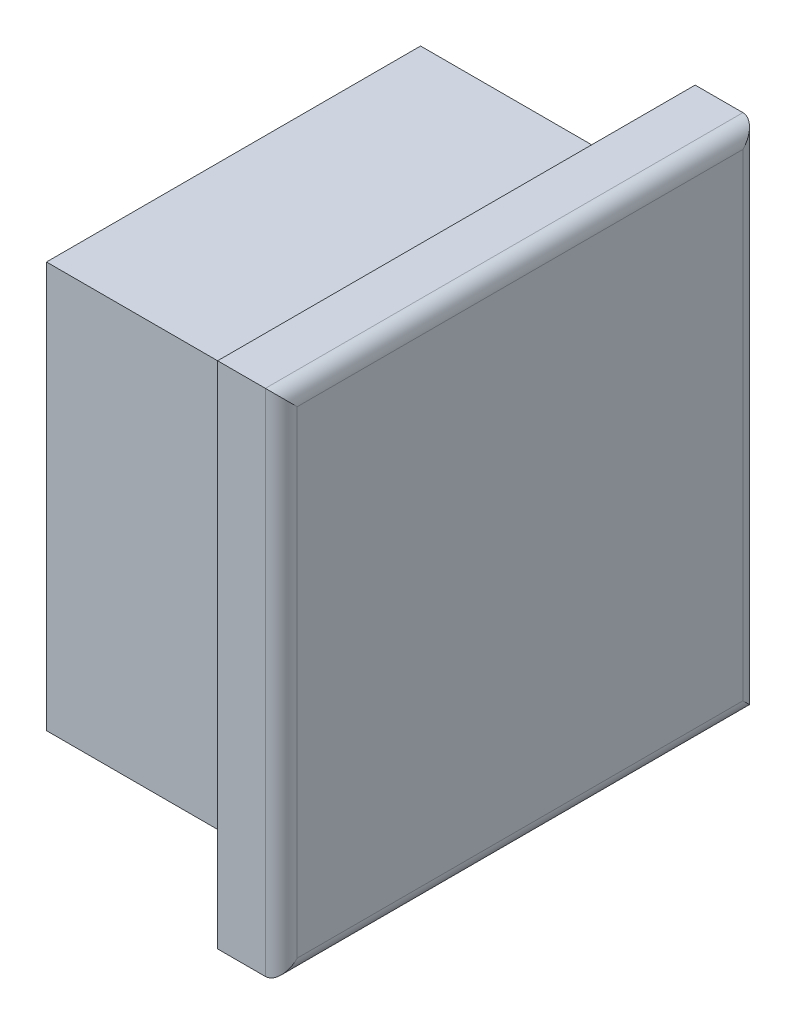
ISO-10303-21;
HEADER;
FILE_DESCRIPTION(('STEP AP214'),'2;1');
FILE_NAME('part.step','',(''),(''),'','','');
FILE_SCHEMA(('AUTOMOTIVE_DESIGN { 1 0 10303 214 1 1 1 1 }'));
ENDSEC;
DATA;
#1=APPLICATION_CONTEXT('core data for automotive mechanical design processes');
#2=APPLICATION_PROTOCOL_DEFINITION('international standard','automotive_design',2000,#1);
#3=PRODUCT_CONTEXT('',#1,'mechanical');
#4=PRODUCT('Part','Part','',(#3));
#5=PRODUCT_RELATED_PRODUCT_CATEGORY('part','',(#4));
#6=PRODUCT_DEFINITION_FORMATION('','',#4);
#7=PRODUCT_DEFINITION_CONTEXT('part definition',#1,'design');
#8=PRODUCT_DEFINITION('design','',#6,#7);
#9=PRODUCT_DEFINITION_SHAPE('','',#8);
#10=(LENGTH_UNIT() NAMED_UNIT(*) SI_UNIT(.MILLI.,.METRE.));
#11=(NAMED_UNIT(*) PLANE_ANGLE_UNIT() SI_UNIT($,.RADIAN.));
#12=(NAMED_UNIT(*) SI_UNIT($,.STERADIAN.) SOLID_ANGLE_UNIT());
#13=UNCERTAINTY_MEASURE_WITH_UNIT(LENGTH_MEASURE(1.E-05),#10,'distance_accuracy_value','');
#14=(GEOMETRIC_REPRESENTATION_CONTEXT(3) GLOBAL_UNCERTAINTY_ASSIGNED_CONTEXT((#13)) GLOBAL_UNIT_ASSIGNED_CONTEXT((#10,
#11,#12)) REPRESENTATION_CONTEXT('',''));
#15=CARTESIAN_POINT('',(0.,0.,0.));
#16=DIRECTION('',(0.,0.,1.));
#17=DIRECTION('',(1.,0.,0.));
#18=AXIS2_PLACEMENT_3D('',#15,#16,#17);
#19=CARTESIAN_POINT('',(-1.032002,-15.999968,14.99997));
#20=DIRECTION('',(-1.,0.,0.));
#21=DIRECTION('',(0.,0.,1.));
#22=AXIS2_PLACEMENT_3D('',#19,#20,#21);
#23=PLANE('',#22);
#24=DIRECTION('',(0.,0.,-1.));
#25=VECTOR('',#24,1.);
#26=CARTESIAN_POINT('',(-1.032002,-26.7179425,3.2499935));
#27=LINE('',#26,#25);
#28=CARTESIAN_POINT('',(-1.032002,-26.7179425,5.2819935));
#29=VERTEX_POINT('',#28);
#30=CARTESIAN_POINT('',(-1.032002,-26.7179425,24.7179465));
#31=VERTEX_POINT('',#30);
#32=EDGE_CURVE('E136',#29,#31,#27,.F.);
#33=ORIENTED_EDGE('',*,*,#32,.T.);
#34=DIRECTION('',(0.,1.,0.));
#35=VECTOR('',#34,1.);
#36=CARTESIAN_POINT('',(-1.032002,-28.7499425,24.7179465));
#37=LINE('',#36,#35);
#38=CARTESIAN_POINT('',(-1.032002,-5.2819935,24.7179465));
#39=VERTEX_POINT('',#38);
#40=EDGE_CURVE('E131',#31,#39,#37,.T.);
#41=ORIENTED_EDGE('',*,*,#40,.T.);
#42=DIRECTION('',(0.,0.,1.));
#43=VECTOR('',#42,1.);
#44=CARTESIAN_POINT('',(-1.032002,-5.2819935,26.7499465));
#45=LINE('',#44,#43);
#46=CARTESIAN_POINT('',(-1.032002,-5.2819935,5.2819935));
#47=VERTEX_POINT('',#46);
#48=EDGE_CURVE('E116',#39,#47,#45,.F.);
#49=ORIENTED_EDGE('',*,*,#48,.T.);
#50=DIRECTION('',(0.,1.,0.));
#51=VECTOR('',#50,1.);
#52=CARTESIAN_POINT('',(-1.032002,-3.2499935,5.2819935));
#53=LINE('',#52,#51);
#54=EDGE_CURVE('E220',#47,#29,#53,.F.);
#55=ORIENTED_EDGE('',*,*,#54,.T.);
#56=EDGE_LOOP('',(#33,#41,#49,#55));
#57=FACE_BOUND('',#56,.T.);
#58=ADVANCED_FACE('F15',(#57),#23,.T.);
#59=CARTESIAN_POINT('',(-16.999966,-5.2819935,26.7499465));
#60=DIRECTION('',(0.,1.,0.));
#61=DIRECTION('',(0.,0.,1.));
#62=AXIS2_PLACEMENT_3D('',#59,#60,#61);
#63=PLANE('',#62);
#64=DIRECTION('',(1.,0.,0.));
#65=VECTOR('',#64,1.);
#66=CARTESIAN_POINT('',(-16.999966,-5.2819935,24.7179465));
#67=LINE('',#66,#65);
#68=CARTESIAN_POINT('',(-16.999966,-5.2819935,24.7179465));
#69=VERTEX_POINT('',#68);
#70=EDGE_CURVE('E120',#39,#69,#67,.F.);
#71=ORIENTED_EDGE('',*,*,#70,.T.);
#72=DIRECTION('',(0.,0.,1.));
#73=VECTOR('',#72,1.);
#74=CARTESIAN_POINT('',(-16.999966,-5.2819935,14.99997));
#75=LINE('',#74,#73);
#76=CARTESIAN_POINT('',(-16.999966,-5.2819935,5.2819935));
#77=VERTEX_POINT('',#76);
#78=EDGE_CURVE('E218',#77,#69,#75,.T.);
#79=ORIENTED_EDGE('',*,*,#78,.F.);
#80=DIRECTION('',(-1.,0.,0.));
#81=VECTOR('',#80,1.);
#82=CARTESIAN_POINT('',(-16.999966,-5.2819935,5.2819935));
#83=LINE('',#82,#81);
#84=EDGE_CURVE('E122',#77,#47,#83,.F.);
#85=ORIENTED_EDGE('',*,*,#84,.T.);
#86=ORIENTED_EDGE('',*,*,#48,.F.);
#87=EDGE_LOOP('',(#71,#79,#85,#86));
#88=FACE_BOUND('',#87,.T.);
#89=ADVANCED_FACE('F118',(#88),#63,.F.);
#90=CARTESIAN_POINT('',(-16.999966,-28.7499425,24.7179465));
#91=DIRECTION('',(0.,0.,1.));
#92=DIRECTION('',(1.,0.,0.));
#93=AXIS2_PLACEMENT_3D('',#90,#91,#92);
#94=PLANE('',#93);
#95=DIRECTION('',(1.,0.,0.));
#96=VECTOR('',#95,1.);
#97=CARTESIAN_POINT('',(-16.999966,-26.7179425,24.7179465));
#98=LINE('',#97,#96);
#99=CARTESIAN_POINT('',(-16.999966,-26.7179425,24.7179465));
#100=VERTEX_POINT('',#99);
#101=EDGE_CURVE('E137',#31,#100,#98,.F.);
#102=ORIENTED_EDGE('',*,*,#101,.T.);
#103=DIRECTION('',(0.,1.,0.));
#104=VECTOR('',#103,1.);
#105=CARTESIAN_POINT('',(-16.999966,-15.999968,24.7179465));
#106=LINE('',#105,#104);
#107=EDGE_CURVE('E133',#69,#100,#106,.F.);
#108=ORIENTED_EDGE('',*,*,#107,.F.);
#109=ORIENTED_EDGE('',*,*,#70,.F.);
#110=ORIENTED_EDGE('',*,*,#40,.F.);
#111=EDGE_LOOP('',(#102,#108,#109,#110));
#112=FACE_BOUND('',#111,.T.);
#113=ADVANCED_FACE('F130',(#112),#94,.F.);
#114=CARTESIAN_POINT('',(-16.999966,-26.7179425,3.2499935));
#115=DIRECTION('',(0.,-1.,0.));
#116=DIRECTION('',(0.,0.,-1.));
#117=AXIS2_PLACEMENT_3D('',#114,#115,#116);
#118=PLANE('',#117);
#119=DIRECTION('',(-1.,0.,0.));
#120=VECTOR('',#119,1.);
#121=CARTESIAN_POINT('',(-16.999966,-26.7179425,5.2819935));
#122=LINE('',#121,#120);
#123=CARTESIAN_POINT('',(-16.999966,-26.7179425,5.2819935));
#124=VERTEX_POINT('',#123);
#125=EDGE_CURVE('E223',#29,#124,#122,.T.);
#126=ORIENTED_EDGE('',*,*,#125,.T.);
#127=DIRECTION('',(0.,0.,1.));
#128=VECTOR('',#127,1.);
#129=CARTESIAN_POINT('',(-16.999966,-26.7179425,14.99997));
#130=LINE('',#129,#128);
#131=EDGE_CURVE('E215',#100,#124,#130,.F.);
#132=ORIENTED_EDGE('',*,*,#131,.F.);
#133=ORIENTED_EDGE('',*,*,#101,.F.);
#134=ORIENTED_EDGE('',*,*,#32,.F.);
#135=EDGE_LOOP('',(#126,#132,#133,#134));
#136=FACE_BOUND('',#135,.T.);
#137=ADVANCED_FACE('F229',(#136),#118,.F.);
#138=CARTESIAN_POINT('',(-16.999966,-3.2499935,5.2819935));
#139=DIRECTION('',(0.,0.,-1.));
#140=DIRECTION('',(-1.,0.,0.));
#141=AXIS2_PLACEMENT_3D('',#138,#139,#140);
#142=PLANE('',#141);
#143=ORIENTED_EDGE('',*,*,#84,.F.);
#144=DIRECTION('',(0.,1.,0.));
#145=VECTOR('',#144,1.);
#146=CARTESIAN_POINT('',(-16.999966,-15.999968,5.2819935));
#147=LINE('',#146,#145);
#148=EDGE_CURVE('E212',#124,#77,#147,.T.);
#149=ORIENTED_EDGE('',*,*,#148,.F.);
#150=ORIENTED_EDGE('',*,*,#125,.F.);
#151=ORIENTED_EDGE('',*,*,#54,.F.);
#152=EDGE_LOOP('',(#143,#149,#150,#151));
#153=FACE_BOUND('',#152,.T.);
#154=ADVANCED_FACE('F231',(#153),#142,.F.);
#155=CARTESIAN_POINT('',(-16.999966,-15.999968,14.99997));
#156=DIRECTION('',(-1.,0.,0.));
#157=DIRECTION('',(0.,0.,1.));
#158=AXIS2_PLACEMENT_3D('',#155,#156,#157);
#159=PLANE('',#158);
#160=ORIENTED_EDGE('',*,*,#131,.T.);
#161=ORIENTED_EDGE('',*,*,#148,.T.);
#162=ORIENTED_EDGE('',*,*,#78,.T.);
#163=ORIENTED_EDGE('',*,*,#107,.T.);
#164=EDGE_LOOP('',(#160,#161,#162,#163));
#165=FACE_BOUND('',#164,.T.);
#166=DIRECTION('',(0.,0.,1.));
#167=VECTOR('',#166,1.);
#168=CARTESIAN_POINT('',(-16.999966,-3.2499935,26.7499465));
#169=LINE('',#168,#167);
#170=CARTESIAN_POINT('',(-16.999966,-3.2499935,3.2499935));
#171=VERTEX_POINT('',#170);
#172=CARTESIAN_POINT('',(-16.999966,-3.2499935,26.7499465));
#173=VERTEX_POINT('',#172);
#174=EDGE_CURVE('E195',#171,#173,#169,.T.);
#175=ORIENTED_EDGE('',*,*,#174,.F.);
#176=DIRECTION('',(0.,1.,0.));
#177=VECTOR('',#176,1.);
#178=CARTESIAN_POINT('',(-16.999966,-3.2499935,3.2499935));
#179=LINE('',#178,#177);
#180=CARTESIAN_POINT('',(-16.999966,-28.7499425,3.2499935));
#181=VERTEX_POINT('',#180);
#182=EDGE_CURVE('E200',#181,#171,#179,.T.);
#183=ORIENTED_EDGE('',*,*,#182,.F.);
#184=DIRECTION('',(0.,0.,-1.));
#185=VECTOR('',#184,1.);
#186=CARTESIAN_POINT('',(-16.999966,-28.7499425,3.2499935));
#187=LINE('',#186,#185);
#188=CARTESIAN_POINT('',(-16.999966,-28.7499425,26.7499465));
#189=VERTEX_POINT('',#188);
#190=EDGE_CURVE('E205',#189,#181,#187,.T.);
#191=ORIENTED_EDGE('',*,*,#190,.F.);
#192=DIRECTION('',(0.,1.,0.));
#193=VECTOR('',#192,1.);
#194=CARTESIAN_POINT('',(-16.999966,-28.7499425,26.7499465));
#195=LINE('',#194,#193);
#196=EDGE_CURVE('E210',#173,#189,#195,.F.);
#197=ORIENTED_EDGE('',*,*,#196,.F.);
#198=EDGE_LOOP('',(#175,#183,#191,#197));
#199=FACE_BOUND('',#198,.T.);
#200=ADVANCED_FACE('F233',(#165,#199),#159,.T.);
#201=CARTESIAN_POINT('',(-16.999966,-28.7499425,26.7499465));
#202=DIRECTION('',(0.,0.,1.));
#203=DIRECTION('',(1.,0.,0.));
#204=AXIS2_PLACEMENT_3D('',#201,#202,#203);
#205=PLANE('',#204);
#206=ORIENTED_EDGE('',*,*,#196,.T.);
#207=DIRECTION('',(1.,0.,0.));
#208=VECTOR('',#207,1.);
#209=CARTESIAN_POINT('',(-16.999966,-28.7499425,26.7499465));
#210=LINE('',#209,#208);
#211=CARTESIAN_POINT('',(-2.999994,-28.7499425,26.7499465));
#212=VERTEX_POINT('',#211);
#213=EDGE_CURVE('E207',#212,#189,#210,.F.);
#214=ORIENTED_EDGE('',*,*,#213,.F.);
#215=DIRECTION('',(0.,1.,0.));
#216=VECTOR('',#215,1.);
#217=CARTESIAN_POINT('',(-2.999994,-15.999968,26.7499465));
#218=LINE('',#217,#216);
#219=CARTESIAN_POINT('',(-2.999994,-3.2499935,26.7499465));
#220=VERTEX_POINT('',#219);
#221=EDGE_CURVE('E187',#220,#212,#218,.F.);
#222=ORIENTED_EDGE('',*,*,#221,.F.);
#223=DIRECTION('',(1.,0.,0.));
#224=VECTOR('',#223,1.);
#225=CARTESIAN_POINT('',(-16.999966,-3.2499935,26.7499465));
#226=LINE('',#225,#224);
#227=EDGE_CURVE('E190',#173,#220,#226,.T.);
#228=ORIENTED_EDGE('',*,*,#227,.F.);
#229=EDGE_LOOP('',(#206,#214,#222,#228));
#230=FACE_BOUND('',#229,.T.);
#231=ADVANCED_FACE('F236',(#230),#205,.T.);
#232=CARTESIAN_POINT('',(-16.999966,-28.7499425,3.2499935));
#233=DIRECTION('',(0.,-1.,0.));
#234=DIRECTION('',(0.,0.,-1.));
#235=AXIS2_PLACEMENT_3D('',#232,#233,#234);
#236=PLANE('',#235);
#237=ORIENTED_EDGE('',*,*,#190,.T.);
#238=DIRECTION('',(-1.,0.,0.));
#239=VECTOR('',#238,1.);
#240=CARTESIAN_POINT('',(-16.999966,-28.7499425,3.2499935));
#241=LINE('',#240,#239);
#242=CARTESIAN_POINT('',(-2.999994,-28.7499425,3.2499935));
#243=VERTEX_POINT('',#242);
#244=EDGE_CURVE('E202',#243,#181,#241,.T.);
#245=ORIENTED_EDGE('',*,*,#244,.F.);
#246=DIRECTION('',(0.,0.,1.));
#247=VECTOR('',#246,1.);
#248=CARTESIAN_POINT('',(-2.999994,-28.7499425,14.99997));
#249=LINE('',#248,#247);
#250=EDGE_CURVE('E184',#212,#243,#249,.F.);
#251=ORIENTED_EDGE('',*,*,#250,.F.);
#252=ORIENTED_EDGE('',*,*,#213,.T.);
#253=EDGE_LOOP('',(#237,#245,#251,#252));
#254=FACE_BOUND('',#253,.T.);
#255=ADVANCED_FACE('F262',(#254),#236,.T.);
#256=CARTESIAN_POINT('',(-16.999966,-3.2499935,3.2499935));
#257=DIRECTION('',(0.,0.,-1.));
#258=DIRECTION('',(-1.,0.,0.));
#259=AXIS2_PLACEMENT_3D('',#256,#257,#258);
#260=PLANE('',#259);
#261=ORIENTED_EDGE('',*,*,#182,.T.);
#262=DIRECTION('',(1.,0.,0.));
#263=VECTOR('',#262,1.);
#264=CARTESIAN_POINT('',(-16.999966,-3.2499935,3.2499935));
#265=LINE('',#264,#263);
#266=CARTESIAN_POINT('',(-2.999994,-3.2499935,3.2499935));
#267=VERTEX_POINT('',#266);
#268=EDGE_CURVE('E197',#267,#171,#265,.F.);
#269=ORIENTED_EDGE('',*,*,#268,.F.);
#270=DIRECTION('',(0.,1.,0.));
#271=VECTOR('',#270,1.);
#272=CARTESIAN_POINT('',(-2.999994,-15.999968,3.2499935));
#273=LINE('',#272,#271);
#274=EDGE_CURVE('E181',#243,#267,#273,.T.);
#275=ORIENTED_EDGE('',*,*,#274,.F.);
#276=ORIENTED_EDGE('',*,*,#244,.T.);
#277=EDGE_LOOP('',(#261,#269,#275,#276));
#278=FACE_BOUND('',#277,.T.);
#279=ADVANCED_FACE('F249',(#278),#260,.T.);
#280=CARTESIAN_POINT('',(-16.999966,-3.2499935,26.7499465));
#281=DIRECTION('',(0.,1.,0.));
#282=DIRECTION('',(0.,0.,1.));
#283=AXIS2_PLACEMENT_3D('',#280,#281,#282);
#284=PLANE('',#283);
#285=ORIENTED_EDGE('',*,*,#174,.T.);
#286=ORIENTED_EDGE('',*,*,#227,.T.);
#287=DIRECTION('',(0.,0.,1.));
#288=VECTOR('',#287,1.);
#289=CARTESIAN_POINT('',(-2.999994,-3.2499935,14.99997));
#290=LINE('',#289,#288);
#291=EDGE_CURVE('E177',#267,#220,#290,.T.);
#292=ORIENTED_EDGE('',*,*,#291,.F.);
#293=ORIENTED_EDGE('',*,*,#268,.T.);
#294=EDGE_LOOP('',(#285,#286,#292,#293));
#295=FACE_BOUND('',#294,.T.);
#296=ADVANCED_FACE('F244',(#295),#284,.T.);
#297=CARTESIAN_POINT('',(-2.999994,-15.999968,14.99997));
#298=DIRECTION('',(-1.,0.,0.));
#299=DIRECTION('',(0.,0.,1.));
#300=AXIS2_PLACEMENT_3D('',#297,#298,#299);
#301=PLANE('',#300);
#302=ORIENTED_EDGE('',*,*,#274,.T.);
#303=ORIENTED_EDGE('',*,*,#291,.T.);
#304=ORIENTED_EDGE('',*,*,#221,.T.);
#305=ORIENTED_EDGE('',*,*,#250,.T.);
#306=EDGE_LOOP('',(#302,#303,#304,#305));
#307=FACE_BOUND('',#306,.T.);
#308=DIRECTION('',(0.,0.,1.));
#309=VECTOR('',#308,1.);
#310=CARTESIAN_POINT('',(-2.999994,0.,29.99994));
#311=LINE('',#310,#309);
#312=CARTESIAN_POINT('',(-2.999994,0.,0.));
#313=VERTEX_POINT('',#312);
#314=CARTESIAN_POINT('',(-2.999994,0.,29.99994));
#315=VERTEX_POINT('',#314);
#316=EDGE_CURVE('E64',#313,#315,#311,.T.);
#317=ORIENTED_EDGE('',*,*,#316,.F.);
#318=DIRECTION('',(0.,1.,0.));
#319=VECTOR('',#318,1.);
#320=CARTESIAN_POINT('',(-2.999994,0.,0.));
#321=LINE('',#320,#319);
#322=CARTESIAN_POINT('',(-2.999994,-31.999936,0.));
#323=VERTEX_POINT('',#322);
#324=EDGE_CURVE('E180',#323,#313,#321,.T.);
#325=ORIENTED_EDGE('',*,*,#324,.F.);
#326=DIRECTION('',(0.,0.,-1.));
#327=VECTOR('',#326,1.);
#328=CARTESIAN_POINT('',(-2.999994,-31.999936,0.));
#329=LINE('',#328,#327);
#330=CARTESIAN_POINT('',(-2.999994,-31.999936,29.99994));
#331=VERTEX_POINT('',#330);
#332=EDGE_CURVE('E174',#331,#323,#329,.T.);
#333=ORIENTED_EDGE('',*,*,#332,.F.);
#334=DIRECTION('',(0.,1.,0.));
#335=VECTOR('',#334,1.);
#336=CARTESIAN_POINT('',(-2.999994,-31.999936,29.99994));
#337=LINE('',#336,#335);
#338=EDGE_CURVE('E172',#315,#331,#337,.F.);
#339=ORIENTED_EDGE('',*,*,#338,.F.);
#340=EDGE_LOOP('',(#317,#325,#333,#339));
#341=FACE_BOUND('',#340,.T.);
#342=ADVANCED_FACE('F256',(#307,#341),#301,.T.);
#343=CARTESIAN_POINT('',(-2.999994,0.,0.));
#344=DIRECTION('',(0.,0.,-1.));
#345=DIRECTION('',(-1.,0.,0.));
#346=AXIS2_PLACEMENT_3D('',#343,#344,#345);
#347=PLANE('',#346);
#348=ORIENTED_EDGE('',*,*,#324,.T.);
#349=DIRECTION('',(1.,0.,0.));
#350=VECTOR('',#349,1.);
#351=CARTESIAN_POINT('',(-2.999994,0.,0.));
#352=LINE('',#351,#350);
#353=CARTESIAN_POINT('',(0.,0.,0.));
#354=VERTEX_POINT('',#353);
#355=EDGE_CURVE('E167',#354,#313,#352,.F.);
#356=ORIENTED_EDGE('',*,*,#355,.F.);
#357=DIRECTION('',(0.,-1.,0.));
#358=VECTOR('',#357,1.);
#359=CARTESIAN_POINT('',(0.,-7.999984,0.));
#360=LINE('',#359,#358);
#361=CARTESIAN_POINT('',(0.,-31.999936,0.));
#362=VERTEX_POINT('',#361);
#363=EDGE_CURVE('E164',#362,#354,#360,.F.);
#364=ORIENTED_EDGE('',*,*,#363,.F.);
#365=DIRECTION('',(1.,0.,0.));
#366=VECTOR('',#365,1.);
#367=CARTESIAN_POINT('',(-2.999994,-31.999936,0.));
#368=LINE('',#367,#366);
#369=EDGE_CURVE('E55',#323,#362,#368,.T.);
#370=ORIENTED_EDGE('',*,*,#369,.F.);
#371=EDGE_LOOP('',(#348,#356,#364,#370));
#372=FACE_BOUND('',#371,.T.);
#373=ADVANCED_FACE('F303',(#372),#347,.T.);
#374=CARTESIAN_POINT('',(-2.999994,-31.999936,0.));
#375=DIRECTION('',(0.,-1.,0.));
#376=DIRECTION('',(0.,0.,-1.));
#377=AXIS2_PLACEMENT_3D('',#374,#375,#376);
#378=PLANE('',#377);
#379=ORIENTED_EDGE('',*,*,#332,.T.);
#380=ORIENTED_EDGE('',*,*,#369,.T.);
#381=DIRECTION('',(0.,0.,1.));
#382=VECTOR('',#381,1.);
#383=CARTESIAN_POINT('',(0.,-31.999936,7.499985));
#384=LINE('',#383,#382);
#385=CARTESIAN_POINT('',(0.,-31.999936,29.99994));
#386=VERTEX_POINT('',#385);
#387=EDGE_CURVE('E157',#386,#362,#384,.F.);
#388=ORIENTED_EDGE('',*,*,#387,.F.);
#389=DIRECTION('',(1.,0.,0.));
#390=VECTOR('',#389,1.);
#391=CARTESIAN_POINT('',(-2.999994,-31.999936,29.99994));
#392=LINE('',#391,#390);
#393=EDGE_CURVE('E169',#331,#386,#392,.T.);
#394=ORIENTED_EDGE('',*,*,#393,.F.);
#395=EDGE_LOOP('',(#379,#380,#388,#394));
#396=FACE_BOUND('',#395,.T.);
#397=ADVANCED_FACE('F299',(#396),#378,.T.);
#398=CARTESIAN_POINT('',(-2.999994,-31.999936,29.99994));
#399=DIRECTION('',(0.,0.,1.));
#400=DIRECTION('',(1.,0.,0.));
#401=AXIS2_PLACEMENT_3D('',#398,#399,#400);
#402=PLANE('',#401);
#403=ORIENTED_EDGE('',*,*,#338,.T.);
#404=ORIENTED_EDGE('',*,*,#393,.T.);
#405=DIRECTION('',(0.,1.,0.));
#406=VECTOR('',#405,1.);
#407=CARTESIAN_POINT('',(0.,-23.999952,29.99994));
#408=LINE('',#407,#406);
#409=CARTESIAN_POINT('',(0.,0.,29.99994));
#410=VERTEX_POINT('',#409);
#411=EDGE_CURVE('E148',#410,#386,#408,.F.);
#412=ORIENTED_EDGE('',*,*,#411,.F.);
#413=DIRECTION('',(1.,0.,0.));
#414=VECTOR('',#413,1.);
#415=CARTESIAN_POINT('',(-2.999994,0.,29.99994));
#416=LINE('',#415,#414);
#417=EDGE_CURVE('E166',#315,#410,#416,.T.);
#418=ORIENTED_EDGE('',*,*,#417,.F.);
#419=EDGE_LOOP('',(#403,#404,#412,#418));
#420=FACE_BOUND('',#419,.T.);
#421=ADVANCED_FACE('F296',(#420),#402,.T.);
#422=CARTESIAN_POINT('',(-2.999994,0.,29.99994));
#423=DIRECTION('',(0.,1.,0.));
#424=DIRECTION('',(0.,0.,1.));
#425=AXIS2_PLACEMENT_3D('',#422,#423,#424);
#426=PLANE('',#425);
#427=ORIENTED_EDGE('',*,*,#316,.T.);
#428=ORIENTED_EDGE('',*,*,#417,.T.);
#429=DIRECTION('',(0.,0.,-1.));
#430=VECTOR('',#429,1.);
#431=CARTESIAN_POINT('',(0.,0.,22.499955));
#432=LINE('',#431,#430);
#433=EDGE_CURVE('E144',#354,#410,#432,.F.);
#434=ORIENTED_EDGE('',*,*,#433,.F.);
#435=ORIENTED_EDGE('',*,*,#355,.T.);
#436=EDGE_LOOP('',(#427,#428,#434,#435));
#437=FACE_BOUND('',#436,.T.);
#438=ADVANCED_FACE('F292',(#437),#426,.T.);
#439=CARTESIAN_POINT('',(0.,-7.999984,0.999998));
#440=DIRECTION('',(0.,-1.,0.));
#441=DIRECTION('',(1.,0.,0.));
#442=AXIS2_PLACEMENT_3D('',#439,#440,#441);
#443=CYLINDRICAL_SURFACE('',#442,0.999998);
#444=ORIENTED_EDGE('',*,*,#363,.T.);
#445=CARTESIAN_POINT('',(0.,-0.999998,0.999997999999999));
#446=DIRECTION('',(0.,-0.707106781186547,-0.707106781186547));
#447=DIRECTION('',(0.,0.707106781186547,-0.707106781186547));
#448=AXIS2_PLACEMENT_3D('',#445,#446,#447);
#449=ELLIPSE('',#448,1.41421073394597,0.999998);
#450=CARTESIAN_POINT('',(0.999998,-0.999998,0.999998));
#451=VERTEX_POINT('',#450);
#452=EDGE_CURVE('E145',#451,#354,#449,.F.);
#453=ORIENTED_EDGE('',*,*,#452,.F.);
#454=DIRECTION('',(0.,1.,0.));
#455=VECTOR('',#454,1.);
#456=CARTESIAN_POINT('',(0.999998,-15.999968,0.999998));
#457=LINE('',#456,#455);
#458=CARTESIAN_POINT('',(0.999998,-30.999938,0.999998));
#459=VERTEX_POINT('',#458);
#460=EDGE_CURVE('E143',#451,#459,#457,.F.);
#461=ORIENTED_EDGE('',*,*,#460,.T.);
#462=CARTESIAN_POINT('',(0.,-30.999938,0.999997999999999));
#463=DIRECTION('',(0.,-0.707106781186547,0.707106781186547));
#464=DIRECTION('',(0.,0.707106781186547,0.707106781186547));
#465=AXIS2_PLACEMENT_3D('',#462,#463,#464);
#466=ELLIPSE('',#465,1.41421073394597,0.999998);
#467=EDGE_CURVE('E18',#362,#459,#466,.T.);
#468=ORIENTED_EDGE('',*,*,#467,.F.);
#469=EDGE_LOOP('',(#444,#453,#461,#468));
#470=FACE_BOUND('',#469,.T.);
#471=ADVANCED_FACE('F288',(#470),#443,.T.);
#472=CARTESIAN_POINT('',(0.,-30.999938,7.499985));
#473=DIRECTION('',(0.,0.,1.));
#474=DIRECTION('',(1.,0.,0.));
#475=AXIS2_PLACEMENT_3D('',#472,#473,#474);
#476=CYLINDRICAL_SURFACE('',#475,0.999998);
#477=ORIENTED_EDGE('',*,*,#387,.T.);
#478=ORIENTED_EDGE('',*,*,#467,.T.);
#479=DIRECTION('',(0.,0.,1.));
#480=VECTOR('',#479,1.);
#481=CARTESIAN_POINT('',(0.999998,-30.999938,14.99997));
#482=LINE('',#481,#480);
#483=CARTESIAN_POINT('',(0.999998,-30.999938,28.999942));
#484=VERTEX_POINT('',#483);
#485=EDGE_CURVE('E160',#459,#484,#482,.T.);
#486=ORIENTED_EDGE('',*,*,#485,.T.);
#487=CARTESIAN_POINT('',(0.,-30.999938,28.999942));
#488=DIRECTION('',(0.,0.707106781186547,0.707106781186547));
#489=DIRECTION('',(0.,0.707106781186547,-0.707106781186547));
#490=AXIS2_PLACEMENT_3D('',#487,#488,#489);
#491=ELLIPSE('',#490,1.41421073394597,0.999998);
#492=EDGE_CURVE('E147',#386,#484,#491,.T.);
#493=ORIENTED_EDGE('',*,*,#492,.F.);
#494=EDGE_LOOP('',(#477,#478,#486,#493));
#495=FACE_BOUND('',#494,.T.);
#496=ADVANCED_FACE('F285',(#495),#476,.T.);
#497=CARTESIAN_POINT('',(0.,-23.999952,28.999942));
#498=DIRECTION('',(0.,1.,0.));
#499=DIRECTION('',(-1.,0.,0.));
#500=AXIS2_PLACEMENT_3D('',#497,#498,#499);
#501=CYLINDRICAL_SURFACE('',#500,0.999998);
#502=ORIENTED_EDGE('',*,*,#411,.T.);
#503=ORIENTED_EDGE('',*,*,#492,.T.);
#504=DIRECTION('',(0.,1.,0.));
#505=VECTOR('',#504,1.);
#506=CARTESIAN_POINT('',(0.999998,-15.999968,28.999942));
#507=LINE('',#506,#505);
#508=CARTESIAN_POINT('',(0.999998,-0.999998,28.999942));
#509=VERTEX_POINT('',#508);
#510=EDGE_CURVE('E24',#484,#509,#507,.T.);
#511=ORIENTED_EDGE('',*,*,#510,.T.);
#512=CARTESIAN_POINT('',(0.,-0.999997999999999,28.999942));
#513=DIRECTION('',(0.,0.707106781186547,-0.707106781186547));
#514=DIRECTION('',(0.,-0.707106781186547,-0.707106781186547));
#515=AXIS2_PLACEMENT_3D('',#512,#513,#514);
#516=ELLIPSE('',#515,1.41421073394597,0.999998);
#517=EDGE_CURVE('E32',#410,#509,#516,.T.);
#518=ORIENTED_EDGE('',*,*,#517,.F.);
#519=EDGE_LOOP('',(#502,#503,#511,#518));
#520=FACE_BOUND('',#519,.T.);
#521=ADVANCED_FACE('F280',(#520),#501,.T.);
#522=CARTESIAN_POINT('',(0.,-0.999998,22.499955));
#523=DIRECTION('',(0.,0.,-1.));
#524=DIRECTION('',(-1.,0.,0.));
#525=AXIS2_PLACEMENT_3D('',#522,#523,#524);
#526=CYLINDRICAL_SURFACE('',#525,0.999998);
#527=ORIENTED_EDGE('',*,*,#433,.T.);
#528=ORIENTED_EDGE('',*,*,#517,.T.);
#529=DIRECTION('',(0.,0.,1.));
#530=VECTOR('',#529,1.);
#531=CARTESIAN_POINT('',(0.999998,-0.999998,14.99997));
#532=LINE('',#531,#530);
#533=EDGE_CURVE('E9',#509,#451,#532,.F.);
#534=ORIENTED_EDGE('',*,*,#533,.T.);
#535=ORIENTED_EDGE('',*,*,#452,.T.);
#536=EDGE_LOOP('',(#527,#528,#534,#535));
#537=FACE_BOUND('',#536,.T.);
#538=ADVANCED_FACE('F274',(#537),#526,.T.);
#539=CARTESIAN_POINT('',(0.999998,-15.999968,14.99997));
#540=DIRECTION('',(-1.,0.,0.));
#541=DIRECTION('',(0.,0.,1.));
#542=AXIS2_PLACEMENT_3D('',#539,#540,#541);
#543=PLANE('',#542);
#544=ORIENTED_EDGE('',*,*,#510,.F.);
#545=ORIENTED_EDGE('',*,*,#485,.F.);
#546=ORIENTED_EDGE('',*,*,#460,.F.);
#547=ORIENTED_EDGE('',*,*,#533,.F.);
#548=EDGE_LOOP('',(#544,#545,#546,#547));
#549=FACE_BOUND('',#548,.T.);
#550=ADVANCED_FACE('F272',(#549),#543,.F.);
#551=CLOSED_SHELL('',(#58,#89,#113,#137,#154,#200,#231,#255,#279,#296,#342,#373,#397,#421,#438,
#471,#496,#521,#538,#550));
#552=MANIFOLD_SOLID_BREP('B1',#551);
#553=ADVANCED_BREP_SHAPE_REPRESENTATION('',(#18,#552),#14);
#554=SHAPE_DEFINITION_REPRESENTATION(#9,#553);
ENDSEC;
END-ISO-10303-21;
